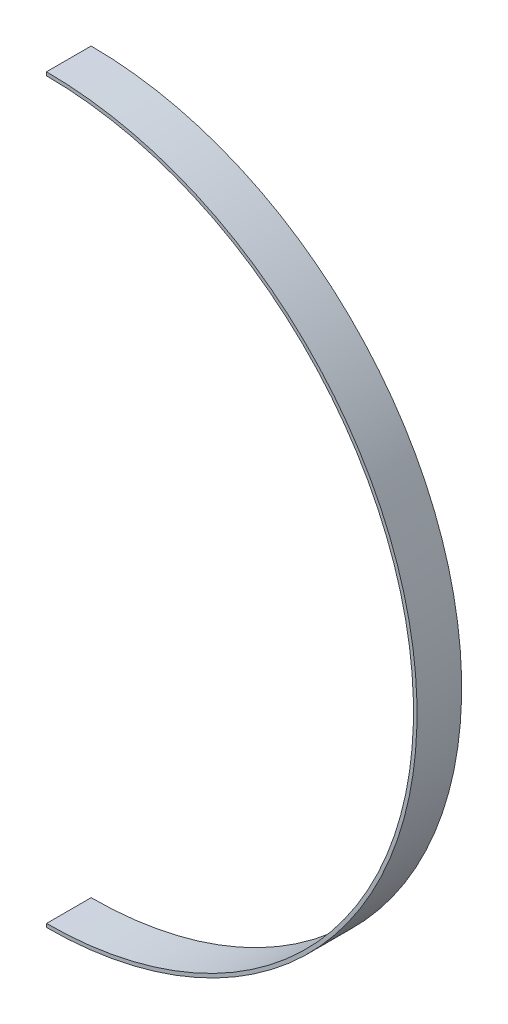
ISO-10303-21;
HEADER;
FILE_DESCRIPTION(('STEP AP214'),'2;1');
FILE_NAME('part.step','',(''),(''),'','','');
FILE_SCHEMA(('AUTOMOTIVE_DESIGN { 1 0 10303 214 1 1 1 1 }'));
ENDSEC;
DATA;
#1=APPLICATION_CONTEXT('core data for automotive mechanical design processes');
#2=APPLICATION_PROTOCOL_DEFINITION('international standard','automotive_design',2000,#1);
#3=PRODUCT_CONTEXT('',#1,'mechanical');
#4=PRODUCT('Part','Part','',(#3));
#5=PRODUCT_RELATED_PRODUCT_CATEGORY('part','',(#4));
#6=PRODUCT_DEFINITION_FORMATION('','',#4);
#7=PRODUCT_DEFINITION_CONTEXT('part definition',#1,'design');
#8=PRODUCT_DEFINITION('design','',#6,#7);
#9=PRODUCT_DEFINITION_SHAPE('','',#8);
#10=(LENGTH_UNIT() NAMED_UNIT(*) SI_UNIT(.MILLI.,.METRE.));
#11=(NAMED_UNIT(*) PLANE_ANGLE_UNIT() SI_UNIT($,.RADIAN.));
#12=(NAMED_UNIT(*) SI_UNIT($,.STERADIAN.) SOLID_ANGLE_UNIT());
#13=UNCERTAINTY_MEASURE_WITH_UNIT(LENGTH_MEASURE(1.E-05),#10,'distance_accuracy_value','');
#14=(GEOMETRIC_REPRESENTATION_CONTEXT(3) GLOBAL_UNCERTAINTY_ASSIGNED_CONTEXT((#13)) GLOBAL_UNIT_ASSIGNED_CONTEXT((#10,
#11,#12)) REPRESENTATION_CONTEXT('',''));
#15=CARTESIAN_POINT('',(0.,0.,0.));
#16=DIRECTION('',(0.,0.,1.));
#17=DIRECTION('',(1.,0.,0.));
#18=AXIS2_PLACEMENT_3D('',#15,#16,#17);
#19=CARTESIAN_POINT('',(0.,-82.25625,10.));
#20=DIRECTION('',(1.,0.,0.));
#21=DIRECTION('',(0.,1.,0.));
#22=AXIS2_PLACEMENT_3D('',#19,#20,#21);
#23=PLANE('',#22);
#24=DIRECTION('',(0.,-1.,0.));
#25=VECTOR('',#24,1.);
#26=CARTESIAN_POINT('',(0.,-82.25625,0.));
#27=LINE('',#26,#25);
#28=CARTESIAN_POINT('',(0.,-82.25625,0.));
#29=VERTEX_POINT('',#28);
#30=CARTESIAN_POINT('',(0.,-83.05,0.));
#31=VERTEX_POINT('',#30);
#32=EDGE_CURVE('E96',#29,#31,#27,.T.);
#33=ORIENTED_EDGE('',*,*,#32,.T.);
#34=DIRECTION('',(0.,0.,-1.));
#35=VECTOR('',#34,1.);
#36=CARTESIAN_POINT('',(0.,-83.05,10.));
#37=LINE('',#36,#35);
#38=CARTESIAN_POINT('',(0.,-83.05,10.));
#39=VERTEX_POINT('',#38);
#40=EDGE_CURVE('E11',#39,#31,#37,.T.);
#41=ORIENTED_EDGE('',*,*,#40,.F.);
#42=DIRECTION('',(0.,-1.,0.));
#43=VECTOR('',#42,1.);
#44=CARTESIAN_POINT('',(0.,-82.25625,10.));
#45=LINE('',#44,#43);
#46=CARTESIAN_POINT('',(0.,-82.25625,10.));
#47=VERTEX_POINT('',#46);
#48=EDGE_CURVE('E82',#47,#39,#45,.T.);
#49=ORIENTED_EDGE('',*,*,#48,.F.);
#50=DIRECTION('',(0.,0.,-1.));
#51=VECTOR('',#50,1.);
#52=CARTESIAN_POINT('',(0.,-82.25625,10.));
#53=LINE('',#52,#51);
#54=EDGE_CURVE('E49',#47,#29,#53,.T.);
#55=ORIENTED_EDGE('',*,*,#54,.T.);
#56=EDGE_LOOP('',(#33,#41,#49,#55));
#57=FACE_BOUND('',#56,.T.);
#58=ADVANCED_FACE('F33',(#57),#23,.F.);
#59=CARTESIAN_POINT('',(0.,0.,10.));
#60=DIRECTION('',(0.,0.,-1.));
#61=DIRECTION('',(-1.,0.,0.));
#62=AXIS2_PLACEMENT_3D('',#59,#60,#61);
#63=CYLINDRICAL_SURFACE('',#62,83.05);
#64=CARTESIAN_POINT('',(0.,0.,0.));
#65=DIRECTION('',(0.,0.,1.));
#66=DIRECTION('',(1.,0.,0.));
#67=AXIS2_PLACEMENT_3D('',#64,#65,#66);
#68=CIRCLE('',#67,83.05);
#69=CARTESIAN_POINT('',(0.,83.05,0.));
#70=VERTEX_POINT('',#69);
#71=EDGE_CURVE('E87',#31,#70,#68,.T.);
#72=ORIENTED_EDGE('',*,*,#71,.T.);
#73=DIRECTION('',(0.,0.,-1.));
#74=VECTOR('',#73,1.);
#75=CARTESIAN_POINT('',(0.,83.05,10.));
#76=LINE('',#75,#74);
#77=CARTESIAN_POINT('',(0.,83.05,10.));
#78=VERTEX_POINT('',#77);
#79=EDGE_CURVE('E41',#78,#70,#76,.T.);
#80=ORIENTED_EDGE('',*,*,#79,.F.);
#81=CARTESIAN_POINT('',(0.,0.,10.));
#82=DIRECTION('',(0.,0.,1.));
#83=DIRECTION('',(1.,0.,0.));
#84=AXIS2_PLACEMENT_3D('',#81,#82,#83);
#85=CIRCLE('',#84,83.05);
#86=EDGE_CURVE('E75',#39,#78,#85,.T.);
#87=ORIENTED_EDGE('',*,*,#86,.F.);
#88=ORIENTED_EDGE('',*,*,#40,.T.);
#89=EDGE_LOOP('',(#72,#80,#87,#88));
#90=FACE_BOUND('',#89,.T.);
#91=ADVANCED_FACE('F86',(#90),#63,.T.);
#92=CARTESIAN_POINT('',(0.,83.05,10.));
#93=DIRECTION('',(1.,0.,0.));
#94=DIRECTION('',(0.,1.,0.));
#95=AXIS2_PLACEMENT_3D('',#92,#93,#94);
#96=PLANE('',#95);
#97=DIRECTION('',(0.,-1.,0.));
#98=VECTOR('',#97,1.);
#99=CARTESIAN_POINT('',(0.,83.05,0.));
#100=LINE('',#99,#98);
#101=CARTESIAN_POINT('',(0.,82.25625,0.));
#102=VERTEX_POINT('',#101);
#103=EDGE_CURVE('E99',#70,#102,#100,.T.);
#104=ORIENTED_EDGE('',*,*,#103,.T.);
#105=DIRECTION('',(0.,0.,-1.));
#106=VECTOR('',#105,1.);
#107=CARTESIAN_POINT('',(0.,82.25625,10.));
#108=LINE('',#107,#106);
#109=CARTESIAN_POINT('',(0.,82.25625,10.));
#110=VERTEX_POINT('',#109);
#111=EDGE_CURVE('E64',#110,#102,#108,.T.);
#112=ORIENTED_EDGE('',*,*,#111,.F.);
#113=DIRECTION('',(0.,-1.,0.));
#114=VECTOR('',#113,1.);
#115=CARTESIAN_POINT('',(0.,83.05,10.));
#116=LINE('',#115,#114);
#117=EDGE_CURVE('E81',#78,#110,#116,.T.);
#118=ORIENTED_EDGE('',*,*,#117,.F.);
#119=ORIENTED_EDGE('',*,*,#79,.T.);
#120=EDGE_LOOP('',(#104,#112,#118,#119));
#121=FACE_BOUND('',#120,.T.);
#122=ADVANCED_FACE('F90',(#121),#96,.F.);
#123=CARTESIAN_POINT('',(0.,0.,10.));
#124=DIRECTION('',(0.,0.,-1.));
#125=DIRECTION('',(-1.,0.,0.));
#126=AXIS2_PLACEMENT_3D('',#123,#124,#125);
#127=CYLINDRICAL_SURFACE('',#126,82.25625);
#128=CARTESIAN_POINT('',(0.,0.,0.));
#129=DIRECTION('',(0.,0.,1.));
#130=DIRECTION('',(1.,0.,0.));
#131=AXIS2_PLACEMENT_3D('',#128,#129,#130);
#132=CIRCLE('',#131,82.25625);
#133=EDGE_CURVE('E101',#29,#102,#132,.T.);
#134=ORIENTED_EDGE('',*,*,#133,.F.);
#135=ORIENTED_EDGE('',*,*,#54,.F.);
#136=CARTESIAN_POINT('',(0.,0.,10.));
#137=DIRECTION('',(0.,0.,1.));
#138=DIRECTION('',(1.,0.,0.));
#139=AXIS2_PLACEMENT_3D('',#136,#137,#138);
#140=CIRCLE('',#139,82.25625);
#141=EDGE_CURVE('E91',#47,#110,#140,.T.);
#142=ORIENTED_EDGE('',*,*,#141,.T.);
#143=ORIENTED_EDGE('',*,*,#111,.T.);
#144=EDGE_LOOP('',(#134,#135,#142,#143));
#145=FACE_BOUND('',#144,.T.);
#146=ADVANCED_FACE('F107',(#145),#127,.F.);
#147=CARTESIAN_POINT('',(0.,0.,10.));
#148=DIRECTION('',(0.,0.,1.));
#149=DIRECTION('',(1.,0.,0.));
#150=AXIS2_PLACEMENT_3D('',#147,#148,#149);
#151=PLANE('',#150);
#152=ORIENTED_EDGE('',*,*,#48,.T.);
#153=ORIENTED_EDGE('',*,*,#86,.T.);
#154=ORIENTED_EDGE('',*,*,#117,.T.);
#155=ORIENTED_EDGE('',*,*,#141,.F.);
#156=EDGE_LOOP('',(#152,#153,#154,#155));
#157=FACE_BOUND('',#156,.T.);
#158=ADVANCED_FACE('F78',(#157),#151,.T.);
#159=CARTESIAN_POINT('',(0.,0.,0.));
#160=DIRECTION('',(0.,0.,1.));
#161=DIRECTION('',(1.,0.,0.));
#162=AXIS2_PLACEMENT_3D('',#159,#160,#161);
#163=PLANE('',#162);
#164=ORIENTED_EDGE('',*,*,#32,.F.);
#165=ORIENTED_EDGE('',*,*,#133,.T.);
#166=ORIENTED_EDGE('',*,*,#103,.F.);
#167=ORIENTED_EDGE('',*,*,#71,.F.);
#168=EDGE_LOOP('',(#164,#165,#166,#167));
#169=FACE_BOUND('',#168,.T.);
#170=ADVANCED_FACE('F106',(#169),#163,.F.);
#171=CLOSED_SHELL('',(#58,#91,#122,#146,#158,#170));
#172=MANIFOLD_SOLID_BREP('B2',#171);
#173=ADVANCED_BREP_SHAPE_REPRESENTATION('',(#18,#172),#14);
#174=SHAPE_DEFINITION_REPRESENTATION(#9,#173);
ENDSEC;
END-ISO-10303-21;
